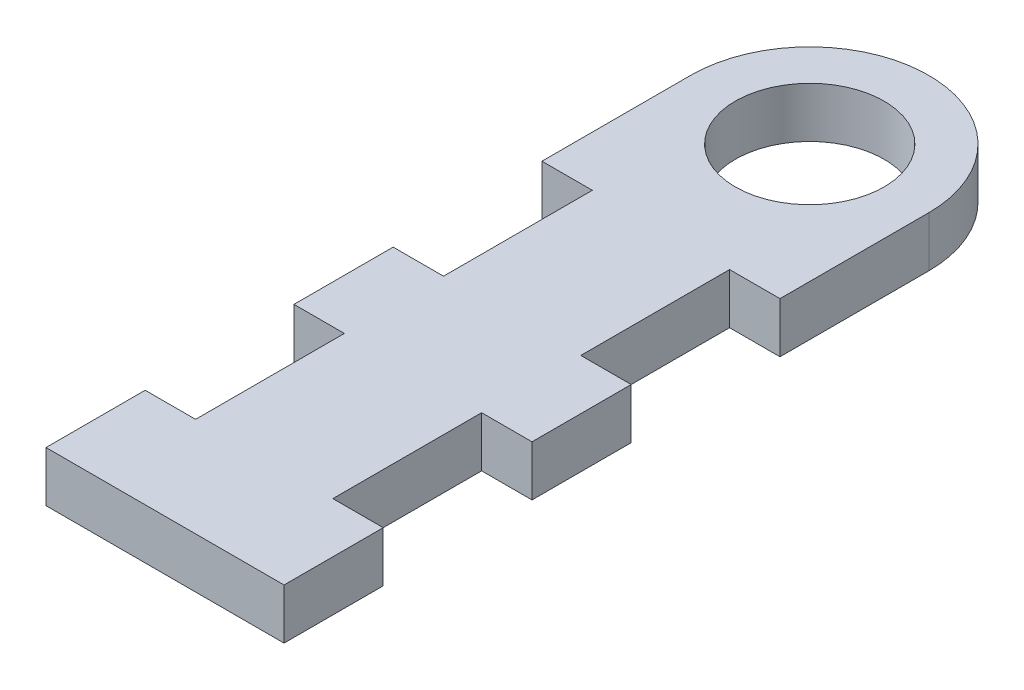
ISO-10303-21;
HEADER;
FILE_DESCRIPTION(('STEP AP214'),'2;1');
FILE_NAME('part.step','',(''),(''),'','','');
FILE_SCHEMA(('AUTOMOTIVE_DESIGN { 1 0 10303 214 1 1 1 1 }'));
ENDSEC;
DATA;
#1=APPLICATION_CONTEXT('core data for automotive mechanical design processes');
#2=APPLICATION_PROTOCOL_DEFINITION('international standard','automotive_design',2000,#1);
#3=PRODUCT_CONTEXT('',#1,'mechanical');
#4=PRODUCT('Part','Part','',(#3));
#5=PRODUCT_RELATED_PRODUCT_CATEGORY('part','',(#4));
#6=PRODUCT_DEFINITION_FORMATION('','',#4);
#7=PRODUCT_DEFINITION_CONTEXT('part definition',#1,'design');
#8=PRODUCT_DEFINITION('design','',#6,#7);
#9=PRODUCT_DEFINITION_SHAPE('','',#8);
#10=(LENGTH_UNIT() NAMED_UNIT(*) SI_UNIT(.MILLI.,.METRE.));
#11=(NAMED_UNIT(*) PLANE_ANGLE_UNIT() SI_UNIT($,.RADIAN.));
#12=(NAMED_UNIT(*) SI_UNIT($,.STERADIAN.) SOLID_ANGLE_UNIT());
#13=UNCERTAINTY_MEASURE_WITH_UNIT(LENGTH_MEASURE(1.E-05),#10,'distance_accuracy_value','');
#14=(GEOMETRIC_REPRESENTATION_CONTEXT(3) GLOBAL_UNCERTAINTY_ASSIGNED_CONTEXT((#13)) GLOBAL_UNIT_ASSIGNED_CONTEXT((#10,
#11,#12)) REPRESENTATION_CONTEXT('',''));
#15=CARTESIAN_POINT('',(0.,0.,0.));
#16=DIRECTION('',(0.,0.,1.));
#17=DIRECTION('',(1.,0.,0.));
#18=AXIS2_PLACEMENT_3D('',#15,#16,#17);
#19=CARTESIAN_POINT('',(0.,5.08,-32.5));
#20=DIRECTION('',(0.,1.,0.));
#21=DIRECTION('',(0.,0.,1.));
#22=AXIS2_PLACEMENT_3D('',#19,#20,#21);
#23=PLANE('',#22);
#24=CARTESIAN_POINT('',(0.,5.08,-32.5));
#25=DIRECTION('',(0.,1.,0.));
#26=DIRECTION('',(0.,0.,1.));
#27=AXIS2_PLACEMENT_3D('',#24,#25,#26);
#28=CIRCLE('',#27,7.5);
#29=CARTESIAN_POINT('',(0.,5.08,-25.));
#30=VERTEX_POINT('',#29);
#31=EDGE_CURVE('E239',#30,#30,#28,.T.);
#32=ORIENTED_EDGE('',*,*,#31,.F.);
#33=EDGE_LOOP('',(#32));
#34=FACE_BOUND('',#33,.T.);
#35=DIRECTION('',(0.,0.,-1.));
#36=VECTOR('',#35,1.);
#37=CARTESIAN_POINT('',(6.92,5.08,-2.50000000000002));
#38=LINE('',#37,#36);
#39=CARTESIAN_POINT('',(6.92,5.08,-2.50000000000002));
#40=VERTEX_POINT('',#39);
#41=CARTESIAN_POINT('',(6.92,5.08,-17.5));
#42=VERTEX_POINT('',#41);
#43=EDGE_CURVE('E188',#40,#42,#38,.T.);
#44=ORIENTED_EDGE('',*,*,#43,.T.);
#45=DIRECTION('',(1.,0.,0.));
#46=VECTOR('',#45,1.);
#47=CARTESIAN_POINT('',(12.,5.08,-17.5));
#48=LINE('',#47,#46);
#49=CARTESIAN_POINT('',(12.,5.08,-17.5));
#50=VERTEX_POINT('',#49);
#51=EDGE_CURVE('E174',#42,#50,#48,.T.);
#52=ORIENTED_EDGE('',*,*,#51,.T.);
#53=DIRECTION('',(0.,0.,-1.));
#54=VECTOR('',#53,1.);
#55=CARTESIAN_POINT('',(12.,5.08,32.5));
#56=LINE('',#55,#54);
#57=CARTESIAN_POINT('',(12.,5.08,-32.5));
#58=VERTEX_POINT('',#57);
#59=EDGE_CURVE('E185',#50,#58,#56,.T.);
#60=ORIENTED_EDGE('',*,*,#59,.T.);
#61=CARTESIAN_POINT('',(0.,5.08,-32.5));
#62=DIRECTION('',(0.,1.,0.));
#63=DIRECTION('',(0.,0.,1.));
#64=AXIS2_PLACEMENT_3D('',#61,#62,#63);
#65=CIRCLE('',#64,12.);
#66=CARTESIAN_POINT('',(-12.,5.08,-32.5));
#67=VERTEX_POINT('',#66);
#68=EDGE_CURVE('E252',#58,#67,#65,.T.);
#69=ORIENTED_EDGE('',*,*,#68,.T.);
#70=DIRECTION('',(0.,0.,1.));
#71=VECTOR('',#70,1.);
#72=CARTESIAN_POINT('',(-12.,5.08,32.5));
#73=LINE('',#72,#71);
#74=CARTESIAN_POINT('',(-12.,5.08,-17.5));
#75=VERTEX_POINT('',#74);
#76=EDGE_CURVE('E199',#67,#75,#73,.T.);
#77=ORIENTED_EDGE('',*,*,#76,.T.);
#78=DIRECTION('',(-1.,0.,0.));
#79=VECTOR('',#78,1.);
#80=CARTESIAN_POINT('',(-12.,5.08,-17.5));
#81=LINE('',#80,#79);
#82=CARTESIAN_POINT('',(-6.92,5.08,-17.5));
#83=VERTEX_POINT('',#82);
#84=EDGE_CURVE('E291',#83,#75,#81,.T.);
#85=ORIENTED_EDGE('',*,*,#84,.F.);
#86=DIRECTION('',(0.,0.,-1.));
#87=VECTOR('',#86,1.);
#88=CARTESIAN_POINT('',(-6.92,5.08,-2.50000000000002));
#89=LINE('',#88,#87);
#90=CARTESIAN_POINT('',(-6.92,5.08,-2.50000000000002));
#91=VERTEX_POINT('',#90);
#92=EDGE_CURVE('E300',#91,#83,#89,.T.);
#93=ORIENTED_EDGE('',*,*,#92,.F.);
#94=DIRECTION('',(1.,0.,0.));
#95=VECTOR('',#94,1.);
#96=CARTESIAN_POINT('',(-12.,5.08,-2.50000000000002));
#97=LINE('',#96,#95);
#98=CARTESIAN_POINT('',(-12.,5.08,-2.50000000000002));
#99=VERTEX_POINT('',#98);
#100=EDGE_CURVE('E303',#99,#91,#97,.T.);
#101=ORIENTED_EDGE('',*,*,#100,.F.);
#102=CARTESIAN_POINT('',(-12.,5.08,7.49999999999998));
#103=VERTEX_POINT('',#102);
#104=EDGE_CURVE('E256',#99,#103,#73,.T.);
#105=ORIENTED_EDGE('',*,*,#104,.T.);
#106=DIRECTION('',(-1.,0.,0.));
#107=VECTOR('',#106,1.);
#108=CARTESIAN_POINT('',(-12.,5.08,7.49999999999998));
#109=LINE('',#108,#107);
#110=CARTESIAN_POINT('',(-6.92,5.08,7.49999999999998));
#111=VERTEX_POINT('',#110);
#112=EDGE_CURVE('E267',#111,#103,#109,.T.);
#113=ORIENTED_EDGE('',*,*,#112,.F.);
#114=DIRECTION('',(0.,0.,-1.));
#115=VECTOR('',#114,1.);
#116=CARTESIAN_POINT('',(-6.92,5.08,22.5));
#117=LINE('',#116,#115);
#118=CARTESIAN_POINT('',(-6.92,5.08,22.5));
#119=VERTEX_POINT('',#118);
#120=EDGE_CURVE('E271',#119,#111,#117,.T.);
#121=ORIENTED_EDGE('',*,*,#120,.F.);
#122=DIRECTION('',(1.,0.,0.));
#123=VECTOR('',#122,1.);
#124=CARTESIAN_POINT('',(-12.,5.08,22.5));
#125=LINE('',#124,#123);
#126=CARTESIAN_POINT('',(-12.,5.08,22.5));
#127=VERTEX_POINT('',#126);
#128=EDGE_CURVE('E261',#127,#119,#125,.T.);
#129=ORIENTED_EDGE('',*,*,#128,.F.);
#130=CARTESIAN_POINT('',(-12.,5.08,32.5));
#131=VERTEX_POINT('',#130);
#132=EDGE_CURVE('E254',#127,#131,#73,.T.);
#133=ORIENTED_EDGE('',*,*,#132,.T.);
#134=DIRECTION('',(1.,0.,0.));
#135=VECTOR('',#134,1.);
#136=CARTESIAN_POINT('',(12.,5.08,32.5));
#137=LINE('',#136,#135);
#138=CARTESIAN_POINT('',(12.,5.08,32.5));
#139=VERTEX_POINT('',#138);
#140=EDGE_CURVE('E195',#131,#139,#137,.T.);
#141=ORIENTED_EDGE('',*,*,#140,.T.);
#142=CARTESIAN_POINT('',(12.,5.08,22.5));
#143=VERTEX_POINT('',#142);
#144=EDGE_CURVE('E197',#139,#143,#56,.T.);
#145=ORIENTED_EDGE('',*,*,#144,.T.);
#146=DIRECTION('',(-1.,0.,0.));
#147=VECTOR('',#146,1.);
#148=CARTESIAN_POINT('',(12.,5.08,22.5));
#149=LINE('',#148,#147);
#150=CARTESIAN_POINT('',(6.92,5.08,22.5));
#151=VERTEX_POINT('',#150);
#152=EDGE_CURVE('E56',#143,#151,#149,.T.);
#153=ORIENTED_EDGE('',*,*,#152,.T.);
#154=DIRECTION('',(0.,0.,-1.));
#155=VECTOR('',#154,1.);
#156=CARTESIAN_POINT('',(6.92,5.08,22.5));
#157=LINE('',#156,#155);
#158=CARTESIAN_POINT('',(6.92,5.08,7.49999999999998));
#159=VERTEX_POINT('',#158);
#160=EDGE_CURVE('E323',#151,#159,#157,.T.);
#161=ORIENTED_EDGE('',*,*,#160,.T.);
#162=DIRECTION('',(1.,0.,0.));
#163=VECTOR('',#162,1.);
#164=CARTESIAN_POINT('',(12.,5.08,7.49999999999998));
#165=LINE('',#164,#163);
#166=CARTESIAN_POINT('',(12.,5.08,7.49999999999998));
#167=VERTEX_POINT('',#166);
#168=EDGE_CURVE('E326',#159,#167,#165,.T.);
#169=ORIENTED_EDGE('',*,*,#168,.T.);
#170=CARTESIAN_POINT('',(12.,5.08,-2.50000000000002));
#171=VERTEX_POINT('',#170);
#172=EDGE_CURVE('E194',#167,#171,#56,.T.);
#173=ORIENTED_EDGE('',*,*,#172,.T.);
#174=DIRECTION('',(-1.,0.,0.));
#175=VECTOR('',#174,1.);
#176=CARTESIAN_POINT('',(12.,5.08,-2.50000000000002));
#177=LINE('',#176,#175);
#178=EDGE_CURVE('E48',#171,#40,#177,.T.);
#179=ORIENTED_EDGE('',*,*,#178,.T.);
#180=EDGE_LOOP('',(#44,#52,#60,#69,#77,#85,#93,#101,#105,#113,#121,#129,#133,#141,#145,#153,
#161,#169,#173,#179));
#181=FACE_BOUND('',#180,.T.);
#182=ADVANCED_FACE('F33',(#34,#181),#23,.T.);
#183=CARTESIAN_POINT('',(0.,0.,-32.5));
#184=DIRECTION('',(0.,1.,0.));
#185=DIRECTION('',(0.,0.,1.));
#186=AXIS2_PLACEMENT_3D('',#183,#184,#185);
#187=PLANE('',#186);
#188=CARTESIAN_POINT('',(0.,0.,-32.5));
#189=DIRECTION('',(0.,1.,0.));
#190=DIRECTION('',(0.,0.,1.));
#191=AXIS2_PLACEMENT_3D('',#188,#189,#190);
#192=CIRCLE('',#191,7.5);
#193=CARTESIAN_POINT('',(0.,0.,-25.));
#194=VERTEX_POINT('',#193);
#195=EDGE_CURVE('E242',#194,#194,#192,.T.);
#196=ORIENTED_EDGE('',*,*,#195,.T.);
#197=EDGE_LOOP('',(#196));
#198=FACE_BOUND('',#197,.T.);
#199=DIRECTION('',(-1.,0.,0.));
#200=VECTOR('',#199,1.);
#201=CARTESIAN_POINT('',(12.,0.,-17.5));
#202=LINE('',#201,#200);
#203=CARTESIAN_POINT('',(12.,0.,-17.5));
#204=VERTEX_POINT('',#203);
#205=CARTESIAN_POINT('',(6.92,0.,-17.5));
#206=VERTEX_POINT('',#205);
#207=EDGE_CURVE('E177',#204,#206,#202,.T.);
#208=ORIENTED_EDGE('',*,*,#207,.T.);
#209=DIRECTION('',(0.,0.,1.));
#210=VECTOR('',#209,1.);
#211=CARTESIAN_POINT('',(6.92,0.,-2.50000000000002));
#212=LINE('',#211,#210);
#213=CARTESIAN_POINT('',(6.92,0.,-2.50000000000002));
#214=VERTEX_POINT('',#213);
#215=EDGE_CURVE('E333',#206,#214,#212,.T.);
#216=ORIENTED_EDGE('',*,*,#215,.T.);
#217=DIRECTION('',(1.,0.,0.));
#218=VECTOR('',#217,1.);
#219=CARTESIAN_POINT('',(12.,0.,-2.50000000000002));
#220=LINE('',#219,#218);
#221=CARTESIAN_POINT('',(12.,0.,-2.50000000000002));
#222=VERTEX_POINT('',#221);
#223=EDGE_CURVE('E329',#214,#222,#220,.T.);
#224=ORIENTED_EDGE('',*,*,#223,.T.);
#225=DIRECTION('',(0.,0.,-1.));
#226=VECTOR('',#225,1.);
#227=CARTESIAN_POINT('',(12.,0.,32.5));
#228=LINE('',#227,#226);
#229=CARTESIAN_POINT('',(12.,0.,7.49999999999998));
#230=VERTEX_POINT('',#229);
#231=EDGE_CURVE('E234',#230,#222,#228,.T.);
#232=ORIENTED_EDGE('',*,*,#231,.F.);
#233=DIRECTION('',(-1.,0.,0.));
#234=VECTOR('',#233,1.);
#235=CARTESIAN_POINT('',(12.,0.,7.49999999999998));
#236=LINE('',#235,#234);
#237=CARTESIAN_POINT('',(6.92,0.,7.49999999999998));
#238=VERTEX_POINT('',#237);
#239=EDGE_CURVE('E310',#230,#238,#236,.T.);
#240=ORIENTED_EDGE('',*,*,#239,.T.);
#241=DIRECTION('',(0.,0.,1.));
#242=VECTOR('',#241,1.);
#243=CARTESIAN_POINT('',(6.92,0.,22.5));
#244=LINE('',#243,#242);
#245=CARTESIAN_POINT('',(6.92,0.,22.5));
#246=VERTEX_POINT('',#245);
#247=EDGE_CURVE('E313',#238,#246,#244,.T.);
#248=ORIENTED_EDGE('',*,*,#247,.T.);
#249=DIRECTION('',(1.,0.,0.));
#250=VECTOR('',#249,1.);
#251=CARTESIAN_POINT('',(12.,0.,22.5));
#252=LINE('',#251,#250);
#253=CARTESIAN_POINT('',(12.,0.,22.5));
#254=VERTEX_POINT('',#253);
#255=EDGE_CURVE('E306',#246,#254,#252,.T.);
#256=ORIENTED_EDGE('',*,*,#255,.T.);
#257=CARTESIAN_POINT('',(12.,0.,32.5));
#258=VERTEX_POINT('',#257);
#259=EDGE_CURVE('E212',#258,#254,#228,.T.);
#260=ORIENTED_EDGE('',*,*,#259,.F.);
#261=DIRECTION('',(1.,0.,0.));
#262=VECTOR('',#261,1.);
#263=CARTESIAN_POINT('',(12.,0.,32.5));
#264=LINE('',#263,#262);
#265=CARTESIAN_POINT('',(-12.,0.,32.5));
#266=VERTEX_POINT('',#265);
#267=EDGE_CURVE('E221',#266,#258,#264,.T.);
#268=ORIENTED_EDGE('',*,*,#267,.F.);
#269=DIRECTION('',(0.,0.,1.));
#270=VECTOR('',#269,1.);
#271=CARTESIAN_POINT('',(-12.,0.,32.5));
#272=LINE('',#271,#270);
#273=CARTESIAN_POINT('',(-12.,0.,22.5));
#274=VERTEX_POINT('',#273);
#275=EDGE_CURVE('E229',#274,#266,#272,.T.);
#276=ORIENTED_EDGE('',*,*,#275,.F.);
#277=DIRECTION('',(-1.,0.,0.));
#278=VECTOR('',#277,1.);
#279=CARTESIAN_POINT('',(-12.,0.,22.5));
#280=LINE('',#279,#278);
#281=CARTESIAN_POINT('',(-6.92,0.,22.5));
#282=VERTEX_POINT('',#281);
#283=EDGE_CURVE('E247',#282,#274,#280,.T.);
#284=ORIENTED_EDGE('',*,*,#283,.F.);
#285=DIRECTION('',(0.,0.,1.));
#286=VECTOR('',#285,1.);
#287=CARTESIAN_POINT('',(-6.92,0.,22.5));
#288=LINE('',#287,#286);
#289=CARTESIAN_POINT('',(-6.92,0.,7.49999999999998));
#290=VERTEX_POINT('',#289);
#291=EDGE_CURVE('E277',#290,#282,#288,.T.);
#292=ORIENTED_EDGE('',*,*,#291,.F.);
#293=DIRECTION('',(1.,0.,0.));
#294=VECTOR('',#293,1.);
#295=CARTESIAN_POINT('',(-12.,0.,7.49999999999998));
#296=LINE('',#295,#294);
#297=CARTESIAN_POINT('',(-12.,0.,7.49999999999998));
#298=VERTEX_POINT('',#297);
#299=EDGE_CURVE('E283',#298,#290,#296,.T.);
#300=ORIENTED_EDGE('',*,*,#299,.F.);
#301=CARTESIAN_POINT('',(-12.,0.,-2.50000000000002));
#302=VERTEX_POINT('',#301);
#303=EDGE_CURVE('E236',#302,#298,#272,.T.);
#304=ORIENTED_EDGE('',*,*,#303,.F.);
#305=DIRECTION('',(-1.,0.,0.));
#306=VECTOR('',#305,1.);
#307=CARTESIAN_POINT('',(-12.,0.,-2.50000000000002));
#308=LINE('',#307,#306);
#309=CARTESIAN_POINT('',(-6.92,0.,-2.50000000000002));
#310=VERTEX_POINT('',#309);
#311=EDGE_CURVE('E282',#310,#302,#308,.T.);
#312=ORIENTED_EDGE('',*,*,#311,.F.);
#313=DIRECTION('',(0.,0.,1.));
#314=VECTOR('',#313,1.);
#315=CARTESIAN_POINT('',(-6.92,0.,-2.50000000000002));
#316=LINE('',#315,#314);
#317=CARTESIAN_POINT('',(-6.92,0.,-17.5));
#318=VERTEX_POINT('',#317);
#319=EDGE_CURVE('E298',#318,#310,#316,.T.);
#320=ORIENTED_EDGE('',*,*,#319,.F.);
#321=DIRECTION('',(1.,0.,0.));
#322=VECTOR('',#321,1.);
#323=CARTESIAN_POINT('',(-12.,0.,-17.5));
#324=LINE('',#323,#322);
#325=CARTESIAN_POINT('',(-12.,0.,-17.5));
#326=VERTEX_POINT('',#325);
#327=EDGE_CURVE('E287',#326,#318,#324,.T.);
#328=ORIENTED_EDGE('',*,*,#327,.F.);
#329=CARTESIAN_POINT('',(-12.,0.,-32.5));
#330=VERTEX_POINT('',#329);
#331=EDGE_CURVE('E233',#330,#326,#272,.T.);
#332=ORIENTED_EDGE('',*,*,#331,.F.);
#333=CARTESIAN_POINT('',(0.,0.,-32.5));
#334=DIRECTION('',(0.,1.,0.));
#335=DIRECTION('',(0.,0.,1.));
#336=AXIS2_PLACEMENT_3D('',#333,#334,#335);
#337=CIRCLE('',#336,12.);
#338=CARTESIAN_POINT('',(12.,0.,-32.5));
#339=VERTEX_POINT('',#338);
#340=EDGE_CURVE('E238',#339,#330,#337,.T.);
#341=ORIENTED_EDGE('',*,*,#340,.F.);
#342=EDGE_CURVE('E232',#204,#339,#228,.T.);
#343=ORIENTED_EDGE('',*,*,#342,.F.);
#344=EDGE_LOOP('',(#208,#216,#224,#232,#240,#248,#256,#260,#268,#276,#284,#292,#300,#304,#312,
#320,#328,#332,#341,#343));
#345=FACE_BOUND('',#344,.T.);
#346=ADVANCED_FACE('F227',(#198,#345),#187,.F.);
#347=CARTESIAN_POINT('',(12.,5.08,32.5));
#348=DIRECTION('',(-1.,0.,0.));
#349=DIRECTION('',(0.,0.,1.));
#350=AXIS2_PLACEMENT_3D('',#347,#348,#349);
#351=PLANE('',#350);
#352=DIRECTION('',(0.,1.,0.));
#353=VECTOR('',#352,1.);
#354=CARTESIAN_POINT('',(12.,-15.8368683773024,-17.5));
#355=LINE('',#354,#353);
#356=EDGE_CURVE('E170',#204,#50,#355,.T.);
#357=ORIENTED_EDGE('',*,*,#356,.F.);
#358=ORIENTED_EDGE('',*,*,#342,.T.);
#359=DIRECTION('',(0.,-1.,0.));
#360=VECTOR('',#359,1.);
#361=CARTESIAN_POINT('',(12.,5.08,-32.5));
#362=LINE('',#361,#360);
#363=EDGE_CURVE('E192',#58,#339,#362,.T.);
#364=ORIENTED_EDGE('',*,*,#363,.F.);
#365=ORIENTED_EDGE('',*,*,#59,.F.);
#366=EDGE_LOOP('',(#357,#358,#364,#365));
#367=FACE_BOUND('',#366,.T.);
#368=ADVANCED_FACE('F190',(#367),#351,.F.);
#369=DIRECTION('',(0.,1.,0.));
#370=VECTOR('',#369,1.);
#371=CARTESIAN_POINT('',(12.,-15.8368683773024,-2.50000000000002));
#372=LINE('',#371,#370);
#373=EDGE_CURVE('E334',#222,#171,#372,.T.);
#374=ORIENTED_EDGE('',*,*,#373,.T.);
#375=ORIENTED_EDGE('',*,*,#172,.F.);
#376=DIRECTION('',(0.,1.,0.));
#377=VECTOR('',#376,1.);
#378=CARTESIAN_POINT('',(12.,-15.8368683773024,7.49999999999998));
#379=LINE('',#378,#377);
#380=EDGE_CURVE('E315',#230,#167,#379,.T.);
#381=ORIENTED_EDGE('',*,*,#380,.F.);
#382=ORIENTED_EDGE('',*,*,#231,.T.);
#383=EDGE_LOOP('',(#374,#375,#381,#382));
#384=FACE_BOUND('',#383,.T.);
#385=ADVANCED_FACE('F353',(#384),#351,.F.);
#386=DIRECTION('',(0.,1.,0.));
#387=VECTOR('',#386,1.);
#388=CARTESIAN_POINT('',(12.,-15.8368683773024,22.5));
#389=LINE('',#388,#387);
#390=EDGE_CURVE('E314',#254,#143,#389,.T.);
#391=ORIENTED_EDGE('',*,*,#390,.T.);
#392=ORIENTED_EDGE('',*,*,#144,.F.);
#393=DIRECTION('',(0.,-1.,0.));
#394=VECTOR('',#393,1.);
#395=CARTESIAN_POINT('',(12.,5.08,32.5));
#396=LINE('',#395,#394);
#397=EDGE_CURVE('E204',#139,#258,#396,.T.);
#398=ORIENTED_EDGE('',*,*,#397,.T.);
#399=ORIENTED_EDGE('',*,*,#259,.T.);
#400=EDGE_LOOP('',(#391,#392,#398,#399));
#401=FACE_BOUND('',#400,.T.);
#402=ADVANCED_FACE('F361',(#401),#351,.F.);
#403=CARTESIAN_POINT('',(-12.,5.08,32.5));
#404=DIRECTION('',(1.,0.,0.));
#405=DIRECTION('',(0.,0.,-1.));
#406=AXIS2_PLACEMENT_3D('',#403,#404,#405);
#407=PLANE('',#406);
#408=ORIENTED_EDGE('',*,*,#331,.T.);
#409=DIRECTION('',(0.,1.,0.));
#410=VECTOR('',#409,1.);
#411=CARTESIAN_POINT('',(-12.,-15.8368683773024,-17.5));
#412=LINE('',#411,#410);
#413=EDGE_CURVE('E295',#326,#75,#412,.T.);
#414=ORIENTED_EDGE('',*,*,#413,.T.);
#415=ORIENTED_EDGE('',*,*,#76,.F.);
#416=DIRECTION('',(0.,-1.,0.));
#417=VECTOR('',#416,1.);
#418=CARTESIAN_POINT('',(-12.,5.08,-32.5));
#419=LINE('',#418,#417);
#420=EDGE_CURVE('E11',#67,#330,#419,.T.);
#421=ORIENTED_EDGE('',*,*,#420,.T.);
#422=EDGE_LOOP('',(#408,#414,#415,#421));
#423=FACE_BOUND('',#422,.T.);
#424=ADVANCED_FACE('F391',(#423),#407,.F.);
#425=ORIENTED_EDGE('',*,*,#104,.F.);
#426=DIRECTION('',(0.,1.,0.));
#427=VECTOR('',#426,1.);
#428=CARTESIAN_POINT('',(-12.,-15.8368683773024,-2.50000000000002));
#429=LINE('',#428,#427);
#430=EDGE_CURVE('E288',#302,#99,#429,.T.);
#431=ORIENTED_EDGE('',*,*,#430,.F.);
#432=ORIENTED_EDGE('',*,*,#303,.T.);
#433=DIRECTION('',(0.,1.,0.));
#434=VECTOR('',#433,1.);
#435=CARTESIAN_POINT('',(-12.,-15.8368683773024,7.49999999999998));
#436=LINE('',#435,#434);
#437=EDGE_CURVE('E275',#298,#103,#436,.T.);
#438=ORIENTED_EDGE('',*,*,#437,.T.);
#439=EDGE_LOOP('',(#425,#431,#432,#438));
#440=FACE_BOUND('',#439,.T.);
#441=ADVANCED_FACE('F392',(#440),#407,.F.);
#442=CARTESIAN_POINT('',(0.,5.08,-32.5));
#443=DIRECTION('',(0.,-1.,0.));
#444=DIRECTION('',(0.,0.,-1.));
#445=AXIS2_PLACEMENT_3D('',#442,#443,#444);
#446=CYLINDRICAL_SURFACE('',#445,12.);
#447=ORIENTED_EDGE('',*,*,#340,.T.);
#448=ORIENTED_EDGE('',*,*,#420,.F.);
#449=ORIENTED_EDGE('',*,*,#68,.F.);
#450=ORIENTED_EDGE('',*,*,#363,.T.);
#451=EDGE_LOOP('',(#447,#448,#449,#450));
#452=FACE_BOUND('',#451,.T.);
#453=ADVANCED_FACE('F35',(#452),#446,.T.);
#454=ORIENTED_EDGE('',*,*,#132,.F.);
#455=DIRECTION('',(0.,1.,0.));
#456=VECTOR('',#455,1.);
#457=CARTESIAN_POINT('',(-12.,-15.8368683773024,22.5));
#458=LINE('',#457,#456);
#459=EDGE_CURVE('E264',#274,#127,#458,.T.);
#460=ORIENTED_EDGE('',*,*,#459,.F.);
#461=ORIENTED_EDGE('',*,*,#275,.T.);
#462=DIRECTION('',(0.,-1.,0.));
#463=VECTOR('',#462,1.);
#464=CARTESIAN_POINT('',(-12.,5.08,32.5));
#465=LINE('',#464,#463);
#466=EDGE_CURVE('E41',#131,#266,#465,.T.);
#467=ORIENTED_EDGE('',*,*,#466,.F.);
#468=EDGE_LOOP('',(#454,#460,#461,#467));
#469=FACE_BOUND('',#468,.T.);
#470=ADVANCED_FACE('F263',(#469),#407,.F.);
#471=CARTESIAN_POINT('',(12.,5.08,32.5));
#472=DIRECTION('',(0.,0.,-1.));
#473=DIRECTION('',(-1.,0.,0.));
#474=AXIS2_PLACEMENT_3D('',#471,#472,#473);
#475=PLANE('',#474);
#476=ORIENTED_EDGE('',*,*,#267,.T.);
#477=ORIENTED_EDGE('',*,*,#397,.F.);
#478=ORIENTED_EDGE('',*,*,#140,.F.);
#479=ORIENTED_EDGE('',*,*,#466,.T.);
#480=EDGE_LOOP('',(#476,#477,#478,#479));
#481=FACE_BOUND('',#480,.T.);
#482=ADVANCED_FACE('F219',(#481),#475,.F.);
#483=CARTESIAN_POINT('',(0.,5.08,-32.5));
#484=DIRECTION('',(0.,-1.,0.));
#485=DIRECTION('',(0.,0.,-1.));
#486=AXIS2_PLACEMENT_3D('',#483,#484,#485);
#487=CYLINDRICAL_SURFACE('',#486,7.5);
#488=ORIENTED_EDGE('',*,*,#31,.T.);
#489=EDGE_LOOP('',(#488));
#490=FACE_BOUND('',#489,.T.);
#491=ORIENTED_EDGE('',*,*,#195,.F.);
#492=EDGE_LOOP('',(#491));
#493=FACE_BOUND('',#492,.T.);
#494=ADVANCED_FACE('F384',(#490,#493),#487,.F.);
#495=CARTESIAN_POINT('',(-12.,-15.8368683773024,7.49999999999998));
#496=DIRECTION('',(0.,0.,-1.));
#497=DIRECTION('',(-1.,0.,0.));
#498=AXIS2_PLACEMENT_3D('',#495,#496,#497);
#499=PLANE('',#498);
#500=ORIENTED_EDGE('',*,*,#299,.T.);
#501=DIRECTION('',(0.,1.,0.));
#502=VECTOR('',#501,1.);
#503=CARTESIAN_POINT('',(-6.92,-15.8368683773024,7.49999999999998));
#504=LINE('',#503,#502);
#505=EDGE_CURVE('E268',#290,#111,#504,.T.);
#506=ORIENTED_EDGE('',*,*,#505,.T.);
#507=ORIENTED_EDGE('',*,*,#112,.T.);
#508=ORIENTED_EDGE('',*,*,#437,.F.);
#509=EDGE_LOOP('',(#500,#506,#507,#508));
#510=FACE_BOUND('',#509,.T.);
#511=ADVANCED_FACE('F410',(#510),#499,.F.);
#512=CARTESIAN_POINT('',(-6.92,-15.8368683773024,22.5));
#513=DIRECTION('',(1.,0.,0.));
#514=DIRECTION('',(0.,0.,-1.));
#515=AXIS2_PLACEMENT_3D('',#512,#513,#514);
#516=PLANE('',#515);
#517=ORIENTED_EDGE('',*,*,#291,.T.);
#518=DIRECTION('',(0.,1.,0.));
#519=VECTOR('',#518,1.);
#520=CARTESIAN_POINT('',(-6.92,-15.8368683773024,22.5));
#521=LINE('',#520,#519);
#522=EDGE_CURVE('E266',#282,#119,#521,.T.);
#523=ORIENTED_EDGE('',*,*,#522,.T.);
#524=ORIENTED_EDGE('',*,*,#120,.T.);
#525=ORIENTED_EDGE('',*,*,#505,.F.);
#526=EDGE_LOOP('',(#517,#523,#524,#525));
#527=FACE_BOUND('',#526,.T.);
#528=ADVANCED_FACE('F415',(#527),#516,.F.);
#529=CARTESIAN_POINT('',(-12.,-15.8368683773024,22.5));
#530=DIRECTION('',(0.,0.,1.));
#531=DIRECTION('',(1.,0.,0.));
#532=AXIS2_PLACEMENT_3D('',#529,#530,#531);
#533=PLANE('',#532);
#534=ORIENTED_EDGE('',*,*,#283,.T.);
#535=ORIENTED_EDGE('',*,*,#459,.T.);
#536=ORIENTED_EDGE('',*,*,#128,.T.);
#537=ORIENTED_EDGE('',*,*,#522,.F.);
#538=EDGE_LOOP('',(#534,#535,#536,#537));
#539=FACE_BOUND('',#538,.T.);
#540=ADVANCED_FACE('F417',(#539),#533,.F.);
#541=CARTESIAN_POINT('',(-12.,-15.8368683773024,-17.5));
#542=DIRECTION('',(0.,0.,-1.));
#543=DIRECTION('',(-1.,0.,0.));
#544=AXIS2_PLACEMENT_3D('',#541,#542,#543);
#545=PLANE('',#544);
#546=ORIENTED_EDGE('',*,*,#327,.T.);
#547=DIRECTION('',(0.,1.,0.));
#548=VECTOR('',#547,1.);
#549=CARTESIAN_POINT('',(-6.92,-15.8368683773024,-17.5));
#550=LINE('',#549,#548);
#551=EDGE_CURVE('E293',#318,#83,#550,.T.);
#552=ORIENTED_EDGE('',*,*,#551,.T.);
#553=ORIENTED_EDGE('',*,*,#84,.T.);
#554=ORIENTED_EDGE('',*,*,#413,.F.);
#555=EDGE_LOOP('',(#546,#552,#553,#554));
#556=FACE_BOUND('',#555,.T.);
#557=ADVANCED_FACE('F419',(#556),#545,.F.);
#558=CARTESIAN_POINT('',(-6.92,-15.8368683773024,-2.50000000000002));
#559=DIRECTION('',(1.,0.,0.));
#560=DIRECTION('',(0.,0.,-1.));
#561=AXIS2_PLACEMENT_3D('',#558,#559,#560);
#562=PLANE('',#561);
#563=ORIENTED_EDGE('',*,*,#319,.T.);
#564=DIRECTION('',(0.,1.,0.));
#565=VECTOR('',#564,1.);
#566=CARTESIAN_POINT('',(-6.92,-15.8368683773024,-2.50000000000002));
#567=LINE('',#566,#565);
#568=EDGE_CURVE('E290',#310,#91,#567,.T.);
#569=ORIENTED_EDGE('',*,*,#568,.T.);
#570=ORIENTED_EDGE('',*,*,#92,.T.);
#571=ORIENTED_EDGE('',*,*,#551,.F.);
#572=EDGE_LOOP('',(#563,#569,#570,#571));
#573=FACE_BOUND('',#572,.T.);
#574=ADVANCED_FACE('F424',(#573),#562,.F.);
#575=CARTESIAN_POINT('',(-12.,-15.8368683773024,-2.50000000000002));
#576=DIRECTION('',(0.,0.,1.));
#577=DIRECTION('',(1.,0.,0.));
#578=AXIS2_PLACEMENT_3D('',#575,#576,#577);
#579=PLANE('',#578);
#580=ORIENTED_EDGE('',*,*,#311,.T.);
#581=ORIENTED_EDGE('',*,*,#430,.T.);
#582=ORIENTED_EDGE('',*,*,#100,.T.);
#583=ORIENTED_EDGE('',*,*,#568,.F.);
#584=EDGE_LOOP('',(#580,#581,#582,#583));
#585=FACE_BOUND('',#584,.T.);
#586=ADVANCED_FACE('F373',(#585),#579,.F.);
#587=CARTESIAN_POINT('',(12.,-15.8368683773024,7.49999999999998));
#588=DIRECTION('',(0.,0.,1.));
#589=DIRECTION('',(1.,0.,0.));
#590=AXIS2_PLACEMENT_3D('',#587,#588,#589);
#591=PLANE('',#590);
#592=ORIENTED_EDGE('',*,*,#380,.T.);
#593=ORIENTED_EDGE('',*,*,#168,.F.);
#594=DIRECTION('',(0.,1.,0.));
#595=VECTOR('',#594,1.);
#596=CARTESIAN_POINT('',(6.92,-15.8368683773024,7.49999999999998));
#597=LINE('',#596,#595);
#598=EDGE_CURVE('E317',#238,#159,#597,.T.);
#599=ORIENTED_EDGE('',*,*,#598,.F.);
#600=ORIENTED_EDGE('',*,*,#239,.F.);
#601=EDGE_LOOP('',(#592,#593,#599,#600));
#602=FACE_BOUND('',#601,.T.);
#603=ADVANCED_FACE('F359',(#602),#591,.T.);
#604=CARTESIAN_POINT('',(6.92,-15.8368683773024,22.5));
#605=DIRECTION('',(1.,0.,0.));
#606=DIRECTION('',(0.,0.,-1.));
#607=AXIS2_PLACEMENT_3D('',#604,#605,#606);
#608=PLANE('',#607);
#609=ORIENTED_EDGE('',*,*,#598,.T.);
#610=ORIENTED_EDGE('',*,*,#160,.F.);
#611=DIRECTION('',(0.,1.,0.));
#612=VECTOR('',#611,1.);
#613=CARTESIAN_POINT('',(6.92,-15.8368683773024,22.5));
#614=LINE('',#613,#612);
#615=EDGE_CURVE('E319',#246,#151,#614,.T.);
#616=ORIENTED_EDGE('',*,*,#615,.F.);
#617=ORIENTED_EDGE('',*,*,#247,.F.);
#618=EDGE_LOOP('',(#609,#610,#616,#617));
#619=FACE_BOUND('',#618,.T.);
#620=ADVANCED_FACE('F365',(#619),#608,.T.);
#621=CARTESIAN_POINT('',(12.,-15.8368683773024,22.5));
#622=DIRECTION('',(0.,0.,-1.));
#623=DIRECTION('',(-1.,0.,0.));
#624=AXIS2_PLACEMENT_3D('',#621,#622,#623);
#625=PLANE('',#624);
#626=ORIENTED_EDGE('',*,*,#615,.T.);
#627=ORIENTED_EDGE('',*,*,#152,.F.);
#628=ORIENTED_EDGE('',*,*,#390,.F.);
#629=ORIENTED_EDGE('',*,*,#255,.F.);
#630=EDGE_LOOP('',(#626,#627,#628,#629));
#631=FACE_BOUND('',#630,.T.);
#632=ADVANCED_FACE('F362',(#631),#625,.T.);
#633=CARTESIAN_POINT('',(12.,-15.8368683773024,-17.5));
#634=DIRECTION('',(0.,0.,1.));
#635=DIRECTION('',(1.,0.,0.));
#636=AXIS2_PLACEMENT_3D('',#633,#634,#635);
#637=PLANE('',#636);
#638=ORIENTED_EDGE('',*,*,#356,.T.);
#639=ORIENTED_EDGE('',*,*,#51,.F.);
#640=DIRECTION('',(0.,1.,0.));
#641=VECTOR('',#640,1.);
#642=CARTESIAN_POINT('',(6.92,-15.8368683773024,-17.5));
#643=LINE('',#642,#641);
#644=EDGE_CURVE('E181',#206,#42,#643,.T.);
#645=ORIENTED_EDGE('',*,*,#644,.F.);
#646=ORIENTED_EDGE('',*,*,#207,.F.);
#647=EDGE_LOOP('',(#638,#639,#645,#646));
#648=FACE_BOUND('',#647,.T.);
#649=ADVANCED_FACE('F172',(#648),#637,.T.);
#650=CARTESIAN_POINT('',(6.92,-15.8368683773024,-2.50000000000002));
#651=DIRECTION('',(1.,0.,0.));
#652=DIRECTION('',(0.,0.,-1.));
#653=AXIS2_PLACEMENT_3D('',#650,#651,#652);
#654=PLANE('',#653);
#655=ORIENTED_EDGE('',*,*,#644,.T.);
#656=ORIENTED_EDGE('',*,*,#43,.F.);
#657=DIRECTION('',(0.,1.,0.));
#658=VECTOR('',#657,1.);
#659=CARTESIAN_POINT('',(6.92,-15.8368683773024,-2.50000000000002));
#660=LINE('',#659,#658);
#661=EDGE_CURVE('E337',#214,#40,#660,.T.);
#662=ORIENTED_EDGE('',*,*,#661,.F.);
#663=ORIENTED_EDGE('',*,*,#215,.F.);
#664=EDGE_LOOP('',(#655,#656,#662,#663));
#665=FACE_BOUND('',#664,.T.);
#666=ADVANCED_FACE('F349',(#665),#654,.T.);
#667=CARTESIAN_POINT('',(12.,-15.8368683773024,-2.50000000000002));
#668=DIRECTION('',(0.,0.,-1.));
#669=DIRECTION('',(-1.,0.,0.));
#670=AXIS2_PLACEMENT_3D('',#667,#668,#669);
#671=PLANE('',#670);
#672=ORIENTED_EDGE('',*,*,#661,.T.);
#673=ORIENTED_EDGE('',*,*,#178,.F.);
#674=ORIENTED_EDGE('',*,*,#373,.F.);
#675=ORIENTED_EDGE('',*,*,#223,.F.);
#676=EDGE_LOOP('',(#672,#673,#674,#675));
#677=FACE_BOUND('',#676,.T.);
#678=ADVANCED_FACE('F350',(#677),#671,.T.);
#679=CLOSED_SHELL('',(#182,#346,#368,#385,#402,#424,#441,#453,#470,#482,#494,#511,#528,#540,
#557,#574,#586,#603,#620,#632,#649,#666,#678));
#680=MANIFOLD_SOLID_BREP('B2',#679);
#681=ADVANCED_BREP_SHAPE_REPRESENTATION('',(#18,#680),#14);
#682=SHAPE_DEFINITION_REPRESENTATION(#9,#681);
ENDSEC;
END-ISO-10303-21;
